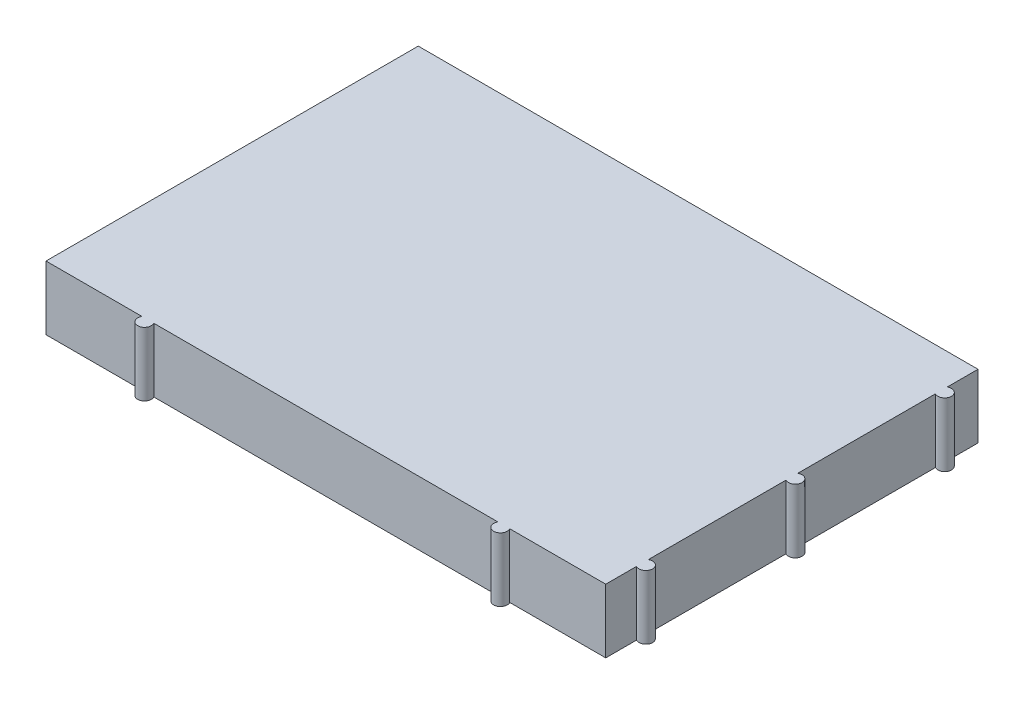
ISO-10303-21;
HEADER;
FILE_DESCRIPTION(('STEP AP214'),'2;1');
FILE_NAME('part.step','',(''),(''),'','','');
FILE_SCHEMA(('AUTOMOTIVE_DESIGN { 1 0 10303 214 1 1 1 1 }'));
ENDSEC;
DATA;
#1=APPLICATION_CONTEXT('core data for automotive mechanical design processes');
#2=APPLICATION_PROTOCOL_DEFINITION('international standard','automotive_design',2000,#1);
#3=PRODUCT_CONTEXT('',#1,'mechanical');
#4=PRODUCT('Part','Part','',(#3));
#5=PRODUCT_RELATED_PRODUCT_CATEGORY('part','',(#4));
#6=PRODUCT_DEFINITION_FORMATION('','',#4);
#7=PRODUCT_DEFINITION_CONTEXT('part definition',#1,'design');
#8=PRODUCT_DEFINITION('design','',#6,#7);
#9=PRODUCT_DEFINITION_SHAPE('','',#8);
#10=(LENGTH_UNIT() NAMED_UNIT(*) SI_UNIT(.MILLI.,.METRE.));
#11=(NAMED_UNIT(*) PLANE_ANGLE_UNIT() SI_UNIT($,.RADIAN.));
#12=(NAMED_UNIT(*) SI_UNIT($,.STERADIAN.) SOLID_ANGLE_UNIT());
#13=UNCERTAINTY_MEASURE_WITH_UNIT(LENGTH_MEASURE(1.E-05),#10,'distance_accuracy_value','');
#14=(GEOMETRIC_REPRESENTATION_CONTEXT(3) GLOBAL_UNCERTAINTY_ASSIGNED_CONTEXT((#13)) GLOBAL_UNIT_ASSIGNED_CONTEXT((#10,
#11,#12)) REPRESENTATION_CONTEXT('',''));
#15=CARTESIAN_POINT('',(0.,0.,0.));
#16=DIRECTION('',(0.,0.,1.));
#17=DIRECTION('',(1.,0.,0.));
#18=AXIS2_PLACEMENT_3D('',#15,#16,#17);
#19=CARTESIAN_POINT('',(41.2,9.4,-22.8660254037844));
#20=DIRECTION('',(-1.,0.,0.));
#21=DIRECTION('',(0.,0.,1.));
#22=AXIS2_PLACEMENT_3D('',#19,#20,#21);
#23=PLANE('',#22);
#24=DIRECTION('',(0.,0.,-1.));
#25=VECTOR('',#24,1.);
#26=CARTESIAN_POINT('',(41.2,0.,-22.8660254037844));
#27=LINE('',#26,#25);
#28=CARTESIAN_POINT('',(41.2,0.,-22.8660254037844));
#29=VERTEX_POINT('',#28);
#30=CARTESIAN_POINT('',(41.2,0.,-27.4));
#31=VERTEX_POINT('',#30);
#32=EDGE_CURVE('E168',#29,#31,#27,.T.);
#33=ORIENTED_EDGE('',*,*,#32,.T.);
#34=DIRECTION('',(0.,-1.,0.));
#35=VECTOR('',#34,1.);
#36=CARTESIAN_POINT('',(41.2,9.4,-27.4));
#37=LINE('',#36,#35);
#38=CARTESIAN_POINT('',(41.2,9.4,-27.4));
#39=VERTEX_POINT('',#38);
#40=EDGE_CURVE('E11',#39,#31,#37,.T.);
#41=ORIENTED_EDGE('',*,*,#40,.F.);
#42=DIRECTION('',(0.,0.,-1.));
#43=VECTOR('',#42,1.);
#44=CARTESIAN_POINT('',(41.2,9.4,-22.8660254037844));
#45=LINE('',#44,#43);
#46=CARTESIAN_POINT('',(41.2,9.4,-22.8660254037844));
#47=VERTEX_POINT('',#46);
#48=EDGE_CURVE('E194',#47,#39,#45,.T.);
#49=ORIENTED_EDGE('',*,*,#48,.F.);
#50=DIRECTION('',(0.,-1.,0.));
#51=VECTOR('',#50,1.);
#52=CARTESIAN_POINT('',(41.2,9.4,-22.8660254037844));
#53=LINE('',#52,#51);
#54=EDGE_CURVE('E164',#47,#29,#53,.T.);
#55=ORIENTED_EDGE('',*,*,#54,.T.);
#56=EDGE_LOOP('',(#33,#41,#49,#55));
#57=FACE_BOUND('',#56,.T.);
#58=ADVANCED_FACE('F36',(#57),#23,.F.);
#59=CARTESIAN_POINT('',(-41.2,9.4,-27.4));
#60=DIRECTION('',(0.,0.,1.));
#61=DIRECTION('',(1.,0.,0.));
#62=AXIS2_PLACEMENT_3D('',#59,#60,#61);
#63=PLANE('',#62);
#64=DIRECTION('',(-1.,0.,0.));
#65=VECTOR('',#64,1.);
#66=CARTESIAN_POINT('',(-41.2,0.,-27.4));
#67=LINE('',#66,#65);
#68=CARTESIAN_POINT('',(-41.2,0.,-27.4));
#69=VERTEX_POINT('',#68);
#70=EDGE_CURVE('E171',#31,#69,#67,.T.);
#71=ORIENTED_EDGE('',*,*,#70,.T.);
#72=DIRECTION('',(0.,-1.,0.));
#73=VECTOR('',#72,1.);
#74=CARTESIAN_POINT('',(-41.2,9.4,-27.4));
#75=LINE('',#74,#73);
#76=CARTESIAN_POINT('',(-41.2,9.4,-27.4));
#77=VERTEX_POINT('',#76);
#78=EDGE_CURVE('E44',#77,#69,#75,.T.);
#79=ORIENTED_EDGE('',*,*,#78,.F.);
#80=DIRECTION('',(-1.,0.,0.));
#81=VECTOR('',#80,1.);
#82=CARTESIAN_POINT('',(-41.2,9.4,-27.4));
#83=LINE('',#82,#81);
#84=EDGE_CURVE('E113',#39,#77,#83,.T.);
#85=ORIENTED_EDGE('',*,*,#84,.F.);
#86=ORIENTED_EDGE('',*,*,#40,.T.);
#87=EDGE_LOOP('',(#71,#79,#85,#86));
#88=FACE_BOUND('',#87,.T.);
#89=ADVANCED_FACE('F282',(#88),#63,.F.);
#90=CARTESIAN_POINT('',(-41.2,9.4,27.4));
#91=DIRECTION('',(1.,0.,0.));
#92=DIRECTION('',(0.,0.,-1.));
#93=AXIS2_PLACEMENT_3D('',#90,#91,#92);
#94=PLANE('',#93);
#95=DIRECTION('',(0.,0.,1.));
#96=VECTOR('',#95,1.);
#97=CARTESIAN_POINT('',(-41.2,0.,27.4));
#98=LINE('',#97,#96);
#99=CARTESIAN_POINT('',(-41.2,0.,27.4));
#100=VERTEX_POINT('',#99);
#101=EDGE_CURVE('E173',#69,#100,#98,.T.);
#102=ORIENTED_EDGE('',*,*,#101,.T.);
#103=DIRECTION('',(0.,-1.,0.));
#104=VECTOR('',#103,1.);
#105=CARTESIAN_POINT('',(-41.2,9.4,27.4));
#106=LINE('',#105,#104);
#107=CARTESIAN_POINT('',(-41.2,9.4,27.4));
#108=VERTEX_POINT('',#107);
#109=EDGE_CURVE('E219',#108,#100,#106,.T.);
#110=ORIENTED_EDGE('',*,*,#109,.F.);
#111=DIRECTION('',(0.,0.,1.));
#112=VECTOR('',#111,1.);
#113=CARTESIAN_POINT('',(-41.2,9.4,27.4));
#114=LINE('',#113,#112);
#115=EDGE_CURVE('E227',#77,#108,#114,.T.);
#116=ORIENTED_EDGE('',*,*,#115,.F.);
#117=ORIENTED_EDGE('',*,*,#78,.T.);
#118=EDGE_LOOP('',(#102,#110,#116,#117));
#119=FACE_BOUND('',#118,.T.);
#120=ADVANCED_FACE('F225',(#119),#94,.F.);
#121=CARTESIAN_POINT('',(-41.2,9.4,27.4));
#122=DIRECTION('',(0.,0.,-1.));
#123=DIRECTION('',(-1.,0.,0.));
#124=AXIS2_PLACEMENT_3D('',#121,#122,#123);
#125=PLANE('',#124);
#126=DIRECTION('',(1.,0.,0.));
#127=VECTOR('',#126,1.);
#128=CARTESIAN_POINT('',(-41.2,0.,27.4));
#129=LINE('',#128,#127);
#130=CARTESIAN_POINT('',(-27.0660254037844,0.,27.4));
#131=VERTEX_POINT('',#130);
#132=EDGE_CURVE('E175',#100,#131,#129,.T.);
#133=ORIENTED_EDGE('',*,*,#132,.T.);
#134=DIRECTION('',(0.,-1.,0.));
#135=VECTOR('',#134,1.);
#136=CARTESIAN_POINT('',(-27.0660254037844,9.4,27.4));
#137=LINE('',#136,#135);
#138=CARTESIAN_POINT('',(-27.0660254037844,9.4,27.4));
#139=VERTEX_POINT('',#138);
#140=EDGE_CURVE('E216',#139,#131,#137,.T.);
#141=ORIENTED_EDGE('',*,*,#140,.F.);
#142=DIRECTION('',(1.,0.,0.));
#143=VECTOR('',#142,1.);
#144=CARTESIAN_POINT('',(-41.2,9.4,27.4));
#145=LINE('',#144,#143);
#146=EDGE_CURVE('E245',#108,#139,#145,.T.);
#147=ORIENTED_EDGE('',*,*,#146,.F.);
#148=ORIENTED_EDGE('',*,*,#109,.T.);
#149=EDGE_LOOP('',(#133,#141,#147,#148));
#150=FACE_BOUND('',#149,.T.);
#151=ADVANCED_FACE('F236',(#150),#125,.F.);
#152=CARTESIAN_POINT('',(-26.2,9.4,27.9));
#153=DIRECTION('',(0.,-1.,0.));
#154=DIRECTION('',(0.,0.,-1.));
#155=AXIS2_PLACEMENT_3D('',#152,#153,#154);
#156=CYLINDRICAL_SURFACE('',#155,1.);
#157=CARTESIAN_POINT('',(-26.2,0.,27.9));
#158=DIRECTION('',(0.,1.,0.));
#159=DIRECTION('',(0.,0.,1.));
#160=AXIS2_PLACEMENT_3D('',#157,#158,#159);
#161=CIRCLE('',#160,1.);
#162=CARTESIAN_POINT('',(-25.3339745962156,0.,27.4));
#163=VERTEX_POINT('',#162);
#164=EDGE_CURVE('E177',#131,#163,#161,.T.);
#165=ORIENTED_EDGE('',*,*,#164,.T.);
#166=DIRECTION('',(0.,-1.,0.));
#167=VECTOR('',#166,1.);
#168=CARTESIAN_POINT('',(-25.3339745962156,9.4,27.4));
#169=LINE('',#168,#167);
#170=CARTESIAN_POINT('',(-25.3339745962156,9.4,27.4));
#171=VERTEX_POINT('',#170);
#172=EDGE_CURVE('E213',#171,#163,#169,.T.);
#173=ORIENTED_EDGE('',*,*,#172,.F.);
#174=CARTESIAN_POINT('',(-26.2,9.4,27.9));
#175=DIRECTION('',(0.,1.,0.));
#176=DIRECTION('',(0.,0.,1.));
#177=AXIS2_PLACEMENT_3D('',#174,#175,#176);
#178=CIRCLE('',#177,1.);
#179=EDGE_CURVE('E242',#139,#171,#178,.T.);
#180=ORIENTED_EDGE('',*,*,#179,.F.);
#181=ORIENTED_EDGE('',*,*,#140,.T.);
#182=EDGE_LOOP('',(#165,#173,#180,#181));
#183=FACE_BOUND('',#182,.T.);
#184=ADVANCED_FACE('F240',(#183),#156,.T.);
#185=CARTESIAN_POINT('',(-25.3339745962156,9.4,27.4));
#186=DIRECTION('',(0.,0.,-1.));
#187=DIRECTION('',(-1.,0.,0.));
#188=AXIS2_PLACEMENT_3D('',#185,#186,#187);
#189=PLANE('',#188);
#190=DIRECTION('',(1.,0.,0.));
#191=VECTOR('',#190,1.);
#192=CARTESIAN_POINT('',(-25.3339745962156,0.,27.4));
#193=LINE('',#192,#191);
#194=CARTESIAN_POINT('',(25.3339745962156,0.,27.4));
#195=VERTEX_POINT('',#194);
#196=EDGE_CURVE('E179',#163,#195,#193,.T.);
#197=ORIENTED_EDGE('',*,*,#196,.T.);
#198=DIRECTION('',(0.,-1.,0.));
#199=VECTOR('',#198,1.);
#200=CARTESIAN_POINT('',(25.3339745962156,9.4,27.4));
#201=LINE('',#200,#199);
#202=CARTESIAN_POINT('',(25.3339745962156,9.4,27.4));
#203=VERTEX_POINT('',#202);
#204=EDGE_CURVE('E210',#203,#195,#201,.T.);
#205=ORIENTED_EDGE('',*,*,#204,.F.);
#206=DIRECTION('',(1.,0.,0.));
#207=VECTOR('',#206,1.);
#208=CARTESIAN_POINT('',(-25.3339745962156,9.4,27.4));
#209=LINE('',#208,#207);
#210=EDGE_CURVE('E244',#171,#203,#209,.T.);
#211=ORIENTED_EDGE('',*,*,#210,.F.);
#212=ORIENTED_EDGE('',*,*,#172,.T.);
#213=EDGE_LOOP('',(#197,#205,#211,#212));
#214=FACE_BOUND('',#213,.T.);
#215=ADVANCED_FACE('F295',(#214),#189,.F.);
#216=CARTESIAN_POINT('',(26.2,9.4,27.9));
#217=DIRECTION('',(0.,-1.,0.));
#218=DIRECTION('',(0.,0.,-1.));
#219=AXIS2_PLACEMENT_3D('',#216,#217,#218);
#220=CYLINDRICAL_SURFACE('',#219,1.);
#221=CARTESIAN_POINT('',(26.2,0.,27.9));
#222=DIRECTION('',(0.,1.,0.));
#223=DIRECTION('',(0.,0.,1.));
#224=AXIS2_PLACEMENT_3D('',#221,#222,#223);
#225=CIRCLE('',#224,1.);
#226=CARTESIAN_POINT('',(27.0660254037844,0.,27.4));
#227=VERTEX_POINT('',#226);
#228=EDGE_CURVE('E181',#195,#227,#225,.T.);
#229=ORIENTED_EDGE('',*,*,#228,.T.);
#230=DIRECTION('',(0.,-1.,0.));
#231=VECTOR('',#230,1.);
#232=CARTESIAN_POINT('',(27.0660254037844,9.4,27.4));
#233=LINE('',#232,#231);
#234=CARTESIAN_POINT('',(27.0660254037844,9.4,27.4));
#235=VERTEX_POINT('',#234);
#236=EDGE_CURVE('E207',#235,#227,#233,.T.);
#237=ORIENTED_EDGE('',*,*,#236,.F.);
#238=CARTESIAN_POINT('',(26.2,9.4,27.9));
#239=DIRECTION('',(0.,1.,0.));
#240=DIRECTION('',(0.,0.,1.));
#241=AXIS2_PLACEMENT_3D('',#238,#239,#240);
#242=CIRCLE('',#241,1.);
#243=EDGE_CURVE('E247',#203,#235,#242,.T.);
#244=ORIENTED_EDGE('',*,*,#243,.F.);
#245=ORIENTED_EDGE('',*,*,#204,.T.);
#246=EDGE_LOOP('',(#229,#237,#244,#245));
#247=FACE_BOUND('',#246,.T.);
#248=ADVANCED_FACE('F298',(#247),#220,.T.);
#249=CARTESIAN_POINT('',(27.0660254037844,9.4,27.4));
#250=DIRECTION('',(0.,0.,-1.));
#251=DIRECTION('',(-1.,0.,0.));
#252=AXIS2_PLACEMENT_3D('',#249,#250,#251);
#253=PLANE('',#252);
#254=DIRECTION('',(1.,0.,0.));
#255=VECTOR('',#254,1.);
#256=CARTESIAN_POINT('',(27.0660254037844,0.,27.4));
#257=LINE('',#256,#255);
#258=CARTESIAN_POINT('',(41.2,0.,27.4));
#259=VERTEX_POINT('',#258);
#260=EDGE_CURVE('E183',#227,#259,#257,.T.);
#261=ORIENTED_EDGE('',*,*,#260,.T.);
#262=DIRECTION('',(0.,-1.,0.));
#263=VECTOR('',#262,1.);
#264=CARTESIAN_POINT('',(41.2,9.4,27.4));
#265=LINE('',#264,#263);
#266=CARTESIAN_POINT('',(41.2,9.4,27.4));
#267=VERTEX_POINT('',#266);
#268=EDGE_CURVE('E204',#267,#259,#265,.T.);
#269=ORIENTED_EDGE('',*,*,#268,.F.);
#270=DIRECTION('',(1.,0.,0.));
#271=VECTOR('',#270,1.);
#272=CARTESIAN_POINT('',(27.0660254037844,9.4,27.4));
#273=LINE('',#272,#271);
#274=EDGE_CURVE('E253',#235,#267,#273,.T.);
#275=ORIENTED_EDGE('',*,*,#274,.F.);
#276=ORIENTED_EDGE('',*,*,#236,.T.);
#277=EDGE_LOOP('',(#261,#269,#275,#276));
#278=FACE_BOUND('',#277,.T.);
#279=ADVANCED_FACE('F302',(#278),#253,.F.);
#280=CARTESIAN_POINT('',(41.2,9.4,27.4));
#281=DIRECTION('',(-1.,0.,0.));
#282=DIRECTION('',(0.,0.,1.));
#283=AXIS2_PLACEMENT_3D('',#280,#281,#282);
#284=PLANE('',#283);
#285=DIRECTION('',(0.,0.,-1.));
#286=VECTOR('',#285,1.);
#287=CARTESIAN_POINT('',(41.2,0.,27.4));
#288=LINE('',#287,#286);
#289=CARTESIAN_POINT('',(41.2,0.,22.8660254037844));
#290=VERTEX_POINT('',#289);
#291=EDGE_CURVE('E185',#259,#290,#288,.T.);
#292=ORIENTED_EDGE('',*,*,#291,.T.);
#293=DIRECTION('',(0.,-1.,0.));
#294=VECTOR('',#293,1.);
#295=CARTESIAN_POINT('',(41.2,9.4,22.8660254037844));
#296=LINE('',#295,#294);
#297=CARTESIAN_POINT('',(41.2,9.4,22.8660254037844));
#298=VERTEX_POINT('',#297);
#299=EDGE_CURVE('E201',#298,#290,#296,.T.);
#300=ORIENTED_EDGE('',*,*,#299,.F.);
#301=DIRECTION('',(0.,0.,-1.));
#302=VECTOR('',#301,1.);
#303=CARTESIAN_POINT('',(41.2,9.4,27.4));
#304=LINE('',#303,#302);
#305=EDGE_CURVE('E255',#267,#298,#304,.T.);
#306=ORIENTED_EDGE('',*,*,#305,.F.);
#307=ORIENTED_EDGE('',*,*,#268,.T.);
#308=EDGE_LOOP('',(#292,#300,#306,#307));
#309=FACE_BOUND('',#308,.T.);
#310=ADVANCED_FACE('F306',(#309),#284,.F.);
#311=CARTESIAN_POINT('',(41.7,9.4,22.));
#312=DIRECTION('',(0.,-1.,0.));
#313=DIRECTION('',(0.,0.,-1.));
#314=AXIS2_PLACEMENT_3D('',#311,#312,#313);
#315=CYLINDRICAL_SURFACE('',#314,1.);
#316=CARTESIAN_POINT('',(41.7,0.,22.));
#317=DIRECTION('',(0.,1.,0.));
#318=DIRECTION('',(0.,0.,1.));
#319=AXIS2_PLACEMENT_3D('',#316,#317,#318);
#320=CIRCLE('',#319,1.);
#321=CARTESIAN_POINT('',(41.2,0.,21.1339745962156));
#322=VERTEX_POINT('',#321);
#323=EDGE_CURVE('E187',#290,#322,#320,.T.);
#324=ORIENTED_EDGE('',*,*,#323,.T.);
#325=DIRECTION('',(0.,-1.,0.));
#326=VECTOR('',#325,1.);
#327=CARTESIAN_POINT('',(41.2,9.4,21.1339745962156));
#328=LINE('',#327,#326);
#329=CARTESIAN_POINT('',(41.2,9.4,21.1339745962156));
#330=VERTEX_POINT('',#329);
#331=EDGE_CURVE('E198',#330,#322,#328,.T.);
#332=ORIENTED_EDGE('',*,*,#331,.F.);
#333=CARTESIAN_POINT('',(41.7,9.4,22.));
#334=DIRECTION('',(0.,1.,0.));
#335=DIRECTION('',(0.,0.,1.));
#336=AXIS2_PLACEMENT_3D('',#333,#334,#335);
#337=CIRCLE('',#336,1.);
#338=EDGE_CURVE('E257',#298,#330,#337,.T.);
#339=ORIENTED_EDGE('',*,*,#338,.F.);
#340=ORIENTED_EDGE('',*,*,#299,.T.);
#341=EDGE_LOOP('',(#324,#332,#339,#340));
#342=FACE_BOUND('',#341,.T.);
#343=ADVANCED_FACE('F263',(#342),#315,.T.);
#344=CARTESIAN_POINT('',(41.2,9.4,21.1339745962156));
#345=DIRECTION('',(-1.,0.,0.));
#346=DIRECTION('',(0.,0.,1.));
#347=AXIS2_PLACEMENT_3D('',#344,#345,#346);
#348=PLANE('',#347);
#349=DIRECTION('',(0.,0.,-1.));
#350=VECTOR('',#349,1.);
#351=CARTESIAN_POINT('',(41.2,0.,21.1339745962156));
#352=LINE('',#351,#350);
#353=CARTESIAN_POINT('',(41.2,0.,0.866025403784438));
#354=VERTEX_POINT('',#353);
#355=EDGE_CURVE('E189',#322,#354,#352,.T.);
#356=ORIENTED_EDGE('',*,*,#355,.T.);
#357=DIRECTION('',(0.,-1.,0.));
#358=VECTOR('',#357,1.);
#359=CARTESIAN_POINT('',(41.2,9.4,0.866025403784438));
#360=LINE('',#359,#358);
#361=CARTESIAN_POINT('',(41.2,9.4,0.866025403784438));
#362=VERTEX_POINT('',#361);
#363=EDGE_CURVE('E159',#362,#354,#360,.T.);
#364=ORIENTED_EDGE('',*,*,#363,.F.);
#365=DIRECTION('',(0.,0.,-1.));
#366=VECTOR('',#365,1.);
#367=CARTESIAN_POINT('',(41.2,9.4,21.1339745962156));
#368=LINE('',#367,#366);
#369=EDGE_CURVE('E150',#330,#362,#368,.T.);
#370=ORIENTED_EDGE('',*,*,#369,.F.);
#371=ORIENTED_EDGE('',*,*,#331,.T.);
#372=EDGE_LOOP('',(#356,#364,#370,#371));
#373=FACE_BOUND('',#372,.T.);
#374=ADVANCED_FACE('F267',(#373),#348,.F.);
#375=CARTESIAN_POINT('',(41.7,9.4,0.));
#376=DIRECTION('',(0.,-1.,0.));
#377=DIRECTION('',(0.,0.,-1.));
#378=AXIS2_PLACEMENT_3D('',#375,#376,#377);
#379=CYLINDRICAL_SURFACE('',#378,1.);
#380=CARTESIAN_POINT('',(41.7,0.,0.));
#381=DIRECTION('',(0.,1.,0.));
#382=DIRECTION('',(0.,0.,1.));
#383=AXIS2_PLACEMENT_3D('',#380,#381,#382);
#384=CIRCLE('',#383,1.);
#385=CARTESIAN_POINT('',(41.2,0.,-0.866025403784439));
#386=VERTEX_POINT('',#385);
#387=EDGE_CURVE('E158',#354,#386,#384,.T.);
#388=ORIENTED_EDGE('',*,*,#387,.T.);
#389=DIRECTION('',(0.,-1.,0.));
#390=VECTOR('',#389,1.);
#391=CARTESIAN_POINT('',(41.2,9.4,-0.866025403784439));
#392=LINE('',#391,#390);
#393=CARTESIAN_POINT('',(41.2,9.4,-0.866025403784439));
#394=VERTEX_POINT('',#393);
#395=EDGE_CURVE('E155',#394,#386,#392,.T.);
#396=ORIENTED_EDGE('',*,*,#395,.F.);
#397=CARTESIAN_POINT('',(41.7,9.4,0.));
#398=DIRECTION('',(0.,1.,0.));
#399=DIRECTION('',(0.,0.,1.));
#400=AXIS2_PLACEMENT_3D('',#397,#398,#399);
#401=CIRCLE('',#400,1.);
#402=EDGE_CURVE('E144',#362,#394,#401,.T.);
#403=ORIENTED_EDGE('',*,*,#402,.F.);
#404=ORIENTED_EDGE('',*,*,#363,.T.);
#405=EDGE_LOOP('',(#388,#396,#403,#404));
#406=FACE_BOUND('',#405,.T.);
#407=ADVANCED_FACE('F156',(#406),#379,.T.);
#408=CARTESIAN_POINT('',(41.2,9.4,-0.866025403784438));
#409=DIRECTION('',(-1.,0.,0.));
#410=DIRECTION('',(0.,0.,1.));
#411=AXIS2_PLACEMENT_3D('',#408,#409,#410);
#412=PLANE('',#411);
#413=DIRECTION('',(0.,0.,-1.));
#414=VECTOR('',#413,1.);
#415=CARTESIAN_POINT('',(41.2,0.,-0.866025403784438));
#416=LINE('',#415,#414);
#417=CARTESIAN_POINT('',(41.2,0.,-21.1339745962156));
#418=VERTEX_POINT('',#417);
#419=EDGE_CURVE('E99',#386,#418,#416,.T.);
#420=ORIENTED_EDGE('',*,*,#419,.T.);
#421=DIRECTION('',(0.,-1.,0.));
#422=VECTOR('',#421,1.);
#423=CARTESIAN_POINT('',(41.2,9.4,-21.1339745962156));
#424=LINE('',#423,#422);
#425=CARTESIAN_POINT('',(41.2,9.4,-21.1339745962156));
#426=VERTEX_POINT('',#425);
#427=EDGE_CURVE('E160',#426,#418,#424,.T.);
#428=ORIENTED_EDGE('',*,*,#427,.F.);
#429=DIRECTION('',(0.,0.,-1.));
#430=VECTOR('',#429,1.);
#431=CARTESIAN_POINT('',(41.2,9.4,-0.866025403784438));
#432=LINE('',#431,#430);
#433=EDGE_CURVE('E148',#394,#426,#432,.T.);
#434=ORIENTED_EDGE('',*,*,#433,.F.);
#435=ORIENTED_EDGE('',*,*,#395,.T.);
#436=EDGE_LOOP('',(#420,#428,#434,#435));
#437=FACE_BOUND('',#436,.T.);
#438=ADVANCED_FACE('F162',(#437),#412,.F.);
#439=CARTESIAN_POINT('',(41.7,9.4,-22.));
#440=DIRECTION('',(0.,-1.,0.));
#441=DIRECTION('',(0.,0.,-1.));
#442=AXIS2_PLACEMENT_3D('',#439,#440,#441);
#443=CYLINDRICAL_SURFACE('',#442,1.);
#444=CARTESIAN_POINT('',(41.7,0.,-22.));
#445=DIRECTION('',(0.,1.,0.));
#446=DIRECTION('',(0.,0.,1.));
#447=AXIS2_PLACEMENT_3D('',#444,#445,#446);
#448=CIRCLE('',#447,1.);
#449=EDGE_CURVE('E105',#418,#29,#448,.T.);
#450=ORIENTED_EDGE('',*,*,#449,.T.);
#451=ORIENTED_EDGE('',*,*,#54,.F.);
#452=CARTESIAN_POINT('',(41.7,9.4,-22.));
#453=DIRECTION('',(0.,1.,0.));
#454=DIRECTION('',(0.,0.,1.));
#455=AXIS2_PLACEMENT_3D('',#452,#453,#454);
#456=CIRCLE('',#455,1.);
#457=EDGE_CURVE('E52',#426,#47,#456,.T.);
#458=ORIENTED_EDGE('',*,*,#457,.F.);
#459=ORIENTED_EDGE('',*,*,#427,.T.);
#460=EDGE_LOOP('',(#450,#451,#458,#459));
#461=FACE_BOUND('',#460,.T.);
#462=ADVANCED_FACE('F271',(#461),#443,.T.);
#463=CARTESIAN_POINT('',(-26.2,9.4,27.9));
#464=DIRECTION('',(0.,1.,0.));
#465=DIRECTION('',(0.,0.,1.));
#466=AXIS2_PLACEMENT_3D('',#463,#464,#465);
#467=PLANE('',#466);
#468=ORIENTED_EDGE('',*,*,#48,.T.);
#469=ORIENTED_EDGE('',*,*,#84,.T.);
#470=ORIENTED_EDGE('',*,*,#115,.T.);
#471=ORIENTED_EDGE('',*,*,#146,.T.);
#472=ORIENTED_EDGE('',*,*,#179,.T.);
#473=ORIENTED_EDGE('',*,*,#210,.T.);
#474=ORIENTED_EDGE('',*,*,#243,.T.);
#475=ORIENTED_EDGE('',*,*,#274,.T.);
#476=ORIENTED_EDGE('',*,*,#305,.T.);
#477=ORIENTED_EDGE('',*,*,#338,.T.);
#478=ORIENTED_EDGE('',*,*,#369,.T.);
#479=ORIENTED_EDGE('',*,*,#402,.T.);
#480=ORIENTED_EDGE('',*,*,#433,.T.);
#481=ORIENTED_EDGE('',*,*,#457,.T.);
#482=EDGE_LOOP('',(#468,#469,#470,#471,#472,#473,#474,#475,#476,#477,#478,#479,#480,#481));
#483=FACE_BOUND('',#482,.T.);
#484=ADVANCED_FACE('F146',(#483),#467,.T.);
#485=CARTESIAN_POINT('',(-26.2,0.,27.9));
#486=DIRECTION('',(0.,1.,0.));
#487=DIRECTION('',(0.,0.,1.));
#488=AXIS2_PLACEMENT_3D('',#485,#486,#487);
#489=PLANE('',#488);
#490=ORIENTED_EDGE('',*,*,#32,.F.);
#491=ORIENTED_EDGE('',*,*,#449,.F.);
#492=ORIENTED_EDGE('',*,*,#419,.F.);
#493=ORIENTED_EDGE('',*,*,#387,.F.);
#494=ORIENTED_EDGE('',*,*,#355,.F.);
#495=ORIENTED_EDGE('',*,*,#323,.F.);
#496=ORIENTED_EDGE('',*,*,#291,.F.);
#497=ORIENTED_EDGE('',*,*,#260,.F.);
#498=ORIENTED_EDGE('',*,*,#228,.F.);
#499=ORIENTED_EDGE('',*,*,#196,.F.);
#500=ORIENTED_EDGE('',*,*,#164,.F.);
#501=ORIENTED_EDGE('',*,*,#132,.F.);
#502=ORIENTED_EDGE('',*,*,#101,.F.);
#503=ORIENTED_EDGE('',*,*,#70,.F.);
#504=EDGE_LOOP('',(#490,#491,#492,#493,#494,#495,#496,#497,#498,#499,#500,#501,#502,#503));
#505=FACE_BOUND('',#504,.T.);
#506=ADVANCED_FACE('F231',(#505),#489,.F.);
#507=CLOSED_SHELL('',(#58,#89,#120,#151,#184,#215,#248,#279,#310,#343,#374,#407,#438,#462,#484,#506));
#508=MANIFOLD_SOLID_BREP('B2',#507);
#509=ADVANCED_BREP_SHAPE_REPRESENTATION('',(#18,#508),#14);
#510=SHAPE_DEFINITION_REPRESENTATION(#9,#509);
ENDSEC;
END-ISO-10303-21;
